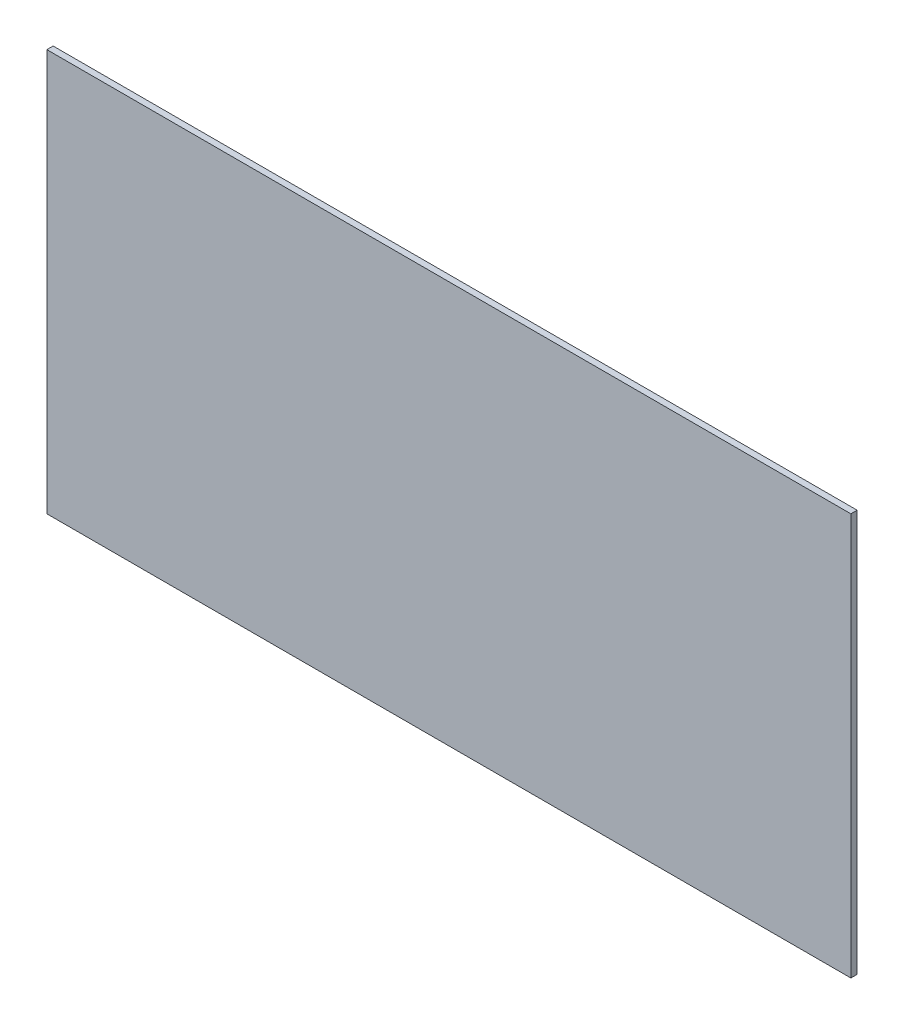
ISO-10303-21;
HEADER;
FILE_DESCRIPTION(('STEP AP214'),'2;1');
FILE_NAME('part.step','',(''),(''),'','','');
FILE_SCHEMA(('AUTOMOTIVE_DESIGN { 1 0 10303 214 1 1 1 1 }'));
ENDSEC;
DATA;
#1=APPLICATION_CONTEXT('core data for automotive mechanical design processes');
#2=APPLICATION_PROTOCOL_DEFINITION('international standard','automotive_design',2000,#1);
#3=PRODUCT_CONTEXT('',#1,'mechanical');
#4=PRODUCT('Part','Part','',(#3));
#5=PRODUCT_RELATED_PRODUCT_CATEGORY('part','',(#4));
#6=PRODUCT_DEFINITION_FORMATION('','',#4);
#7=PRODUCT_DEFINITION_CONTEXT('part definition',#1,'design');
#8=PRODUCT_DEFINITION('design','',#6,#7);
#9=PRODUCT_DEFINITION_SHAPE('','',#8);
#10=(LENGTH_UNIT() NAMED_UNIT(*) SI_UNIT(.MILLI.,.METRE.));
#11=(NAMED_UNIT(*) PLANE_ANGLE_UNIT() SI_UNIT($,.RADIAN.));
#12=(NAMED_UNIT(*) SI_UNIT($,.STERADIAN.) SOLID_ANGLE_UNIT());
#13=UNCERTAINTY_MEASURE_WITH_UNIT(LENGTH_MEASURE(1.E-05),#10,'distance_accuracy_value','');
#14=(GEOMETRIC_REPRESENTATION_CONTEXT(3) GLOBAL_UNCERTAINTY_ASSIGNED_CONTEXT((#13)) GLOBAL_UNIT_ASSIGNED_CONTEXT((#10,
#11,#12)) REPRESENTATION_CONTEXT('',''));
#15=CARTESIAN_POINT('',(0.,0.,0.));
#16=DIRECTION('',(0.,0.,1.));
#17=DIRECTION('',(1.,0.,0.));
#18=AXIS2_PLACEMENT_3D('',#15,#16,#17);
#19=CARTESIAN_POINT('',(167.247619583351,77.7111116817968,3.175));
#20=DIRECTION('',(0.,0.,1.));
#21=DIRECTION('',(1.,0.,0.));
#22=AXIS2_PLACEMENT_3D('',#19,#20,#21);
#23=PLANE('',#22);
#24=DIRECTION('',(0.,1.,0.));
#25=VECTOR('',#24,1.);
#26=CARTESIAN_POINT('',(370.44761958335,179.311111681797,3.175));
#27=LINE('',#26,#25);
#28=CARTESIAN_POINT('',(370.44761958335,179.311111681797,3.175));
#29=VERTEX_POINT('',#28);
#30=CARTESIAN_POINT('',(370.44761958335,-23.8888883182033,3.175));
#31=VERTEX_POINT('',#30);
#32=EDGE_CURVE('E68',#29,#31,#27,.F.);
#33=ORIENTED_EDGE('',*,*,#32,.F.);
#34=DIRECTION('',(1.,0.,0.));
#35=VECTOR('',#34,1.);
#36=CARTESIAN_POINT('',(-35.9523804166488,179.311111681797,3.175));
#37=LINE('',#36,#35);
#38=CARTESIAN_POINT('',(-35.9523804166488,179.311111681797,3.175));
#39=VERTEX_POINT('',#38);
#40=EDGE_CURVE('E20',#39,#29,#37,.T.);
#41=ORIENTED_EDGE('',*,*,#40,.F.);
#42=DIRECTION('',(0.,1.,0.));
#43=VECTOR('',#42,1.);
#44=CARTESIAN_POINT('',(-35.9523804166488,-23.8888883182033,3.175));
#45=LINE('',#44,#43);
#46=CARTESIAN_POINT('',(-35.9523804166488,-23.8888883182033,3.175));
#47=VERTEX_POINT('',#46);
#48=EDGE_CURVE('E58',#47,#39,#45,.T.);
#49=ORIENTED_EDGE('',*,*,#48,.F.);
#50=DIRECTION('',(1.,0.,0.));
#51=VECTOR('',#50,1.);
#52=CARTESIAN_POINT('',(370.44761958335,-23.8888883182033,3.175));
#53=LINE('',#52,#51);
#54=EDGE_CURVE('E53',#31,#47,#53,.F.);
#55=ORIENTED_EDGE('',*,*,#54,.F.);
#56=EDGE_LOOP('',(#33,#41,#49,#55));
#57=FACE_BOUND('',#56,.T.);
#58=ADVANCED_FACE('F17',(#57),#23,.T.);
#59=CARTESIAN_POINT('',(-35.9523804166488,179.311111681797,0.));
#60=DIRECTION('',(0.,1.,0.));
#61=DIRECTION('',(0.,0.,1.));
#62=AXIS2_PLACEMENT_3D('',#59,#60,#61);
#63=PLANE('',#62);
#64=ORIENTED_EDGE('',*,*,#40,.T.);
#65=DIRECTION('',(0.,0.,-1.));
#66=VECTOR('',#65,1.);
#67=CARTESIAN_POINT('',(370.44761958335,179.311111681797,0.));
#68=LINE('',#67,#66);
#69=CARTESIAN_POINT('',(370.44761958335,179.311111681797,0.));
#70=VERTEX_POINT('',#69);
#71=EDGE_CURVE('E79',#70,#29,#68,.F.);
#72=ORIENTED_EDGE('',*,*,#71,.F.);
#73=DIRECTION('',(1.,0.,0.));
#74=VECTOR('',#73,1.);
#75=CARTESIAN_POINT('',(167.247619583351,179.311111681797,0.));
#76=LINE('',#75,#74);
#77=CARTESIAN_POINT('',(-35.9523804166488,179.311111681797,0.));
#78=VERTEX_POINT('',#77);
#79=EDGE_CURVE('E74',#70,#78,#76,.F.);
#80=ORIENTED_EDGE('',*,*,#79,.T.);
#81=DIRECTION('',(0.,0.,1.));
#82=VECTOR('',#81,1.);
#83=CARTESIAN_POINT('',(-35.9523804166488,179.311111681797,0.));
#84=LINE('',#83,#82);
#85=EDGE_CURVE('E63',#39,#78,#84,.F.);
#86=ORIENTED_EDGE('',*,*,#85,.F.);
#87=EDGE_LOOP('',(#64,#72,#80,#86));
#88=FACE_BOUND('',#87,.T.);
#89=ADVANCED_FACE('F73',(#88),#63,.T.);
#90=CARTESIAN_POINT('',(-35.9523804166488,-23.8888883182033,0.));
#91=DIRECTION('',(-1.,0.,0.));
#92=DIRECTION('',(0.,0.,1.));
#93=AXIS2_PLACEMENT_3D('',#90,#91,#92);
#94=PLANE('',#93);
#95=ORIENTED_EDGE('',*,*,#48,.T.);
#96=ORIENTED_EDGE('',*,*,#85,.T.);
#97=DIRECTION('',(0.,1.,0.));
#98=VECTOR('',#97,1.);
#99=CARTESIAN_POINT('',(-35.9523804166488,77.7111116817968,0.));
#100=LINE('',#99,#98);
#101=CARTESIAN_POINT('',(-35.9523804166488,-23.8888883182033,0.));
#102=VERTEX_POINT('',#101);
#103=EDGE_CURVE('E84',#78,#102,#100,.F.);
#104=ORIENTED_EDGE('',*,*,#103,.T.);
#105=DIRECTION('',(0.,0.,-1.));
#106=VECTOR('',#105,1.);
#107=CARTESIAN_POINT('',(-35.9523804166488,-23.8888883182033,0.));
#108=LINE('',#107,#106);
#109=EDGE_CURVE('E65',#47,#102,#108,.T.);
#110=ORIENTED_EDGE('',*,*,#109,.F.);
#111=EDGE_LOOP('',(#95,#96,#104,#110));
#112=FACE_BOUND('',#111,.T.);
#113=ADVANCED_FACE('F60',(#112),#94,.T.);
#114=CARTESIAN_POINT('',(370.44761958335,-23.8888883182033,0.));
#115=DIRECTION('',(0.,-1.,0.));
#116=DIRECTION('',(0.,0.,-1.));
#117=AXIS2_PLACEMENT_3D('',#114,#115,#116);
#118=PLANE('',#117);
#119=ORIENTED_EDGE('',*,*,#54,.T.);
#120=ORIENTED_EDGE('',*,*,#109,.T.);
#121=DIRECTION('',(1.,0.,0.));
#122=VECTOR('',#121,1.);
#123=CARTESIAN_POINT('',(167.247619583351,-23.8888883182033,0.));
#124=LINE('',#123,#122);
#125=CARTESIAN_POINT('',(370.44761958335,-23.8888883182033,0.));
#126=VERTEX_POINT('',#125);
#127=EDGE_CURVE('E26',#102,#126,#124,.T.);
#128=ORIENTED_EDGE('',*,*,#127,.T.);
#129=DIRECTION('',(0.,0.,-1.));
#130=VECTOR('',#129,1.);
#131=CARTESIAN_POINT('',(370.44761958335,-23.8888883182033,0.));
#132=LINE('',#131,#130);
#133=EDGE_CURVE('E34',#31,#126,#132,.T.);
#134=ORIENTED_EDGE('',*,*,#133,.F.);
#135=EDGE_LOOP('',(#119,#120,#128,#134));
#136=FACE_BOUND('',#135,.T.);
#137=ADVANCED_FACE('F88',(#136),#118,.T.);
#138=CARTESIAN_POINT('',(370.44761958335,179.311111681797,0.));
#139=DIRECTION('',(1.,0.,0.));
#140=DIRECTION('',(0.,0.,-1.));
#141=AXIS2_PLACEMENT_3D('',#138,#139,#140);
#142=PLANE('',#141);
#143=ORIENTED_EDGE('',*,*,#32,.T.);
#144=ORIENTED_EDGE('',*,*,#133,.T.);
#145=DIRECTION('',(0.,1.,0.));
#146=VECTOR('',#145,1.);
#147=CARTESIAN_POINT('',(370.44761958335,77.7111116817968,0.));
#148=LINE('',#147,#146);
#149=EDGE_CURVE('E11',#126,#70,#148,.T.);
#150=ORIENTED_EDGE('',*,*,#149,.T.);
#151=ORIENTED_EDGE('',*,*,#71,.T.);
#152=EDGE_LOOP('',(#143,#144,#150,#151));
#153=FACE_BOUND('',#152,.T.);
#154=ADVANCED_FACE('F91',(#153),#142,.T.);
#155=CARTESIAN_POINT('',(167.247619583351,77.7111116817968,0.));
#156=DIRECTION('',(0.,0.,1.));
#157=DIRECTION('',(1.,0.,0.));
#158=AXIS2_PLACEMENT_3D('',#155,#156,#157);
#159=PLANE('',#158);
#160=ORIENTED_EDGE('',*,*,#127,.F.);
#161=ORIENTED_EDGE('',*,*,#103,.F.);
#162=ORIENTED_EDGE('',*,*,#79,.F.);
#163=ORIENTED_EDGE('',*,*,#149,.F.);
#164=EDGE_LOOP('',(#160,#161,#162,#163));
#165=FACE_BOUND('',#164,.T.);
#166=ADVANCED_FACE('F90',(#165),#159,.F.);
#167=CLOSED_SHELL('',(#58,#89,#113,#137,#154,#166));
#168=MANIFOLD_SOLID_BREP('B1',#167);
#169=ADVANCED_BREP_SHAPE_REPRESENTATION('',(#18,#168),#14);
#170=SHAPE_DEFINITION_REPRESENTATION(#9,#169);
ENDSEC;
END-ISO-10303-21;
